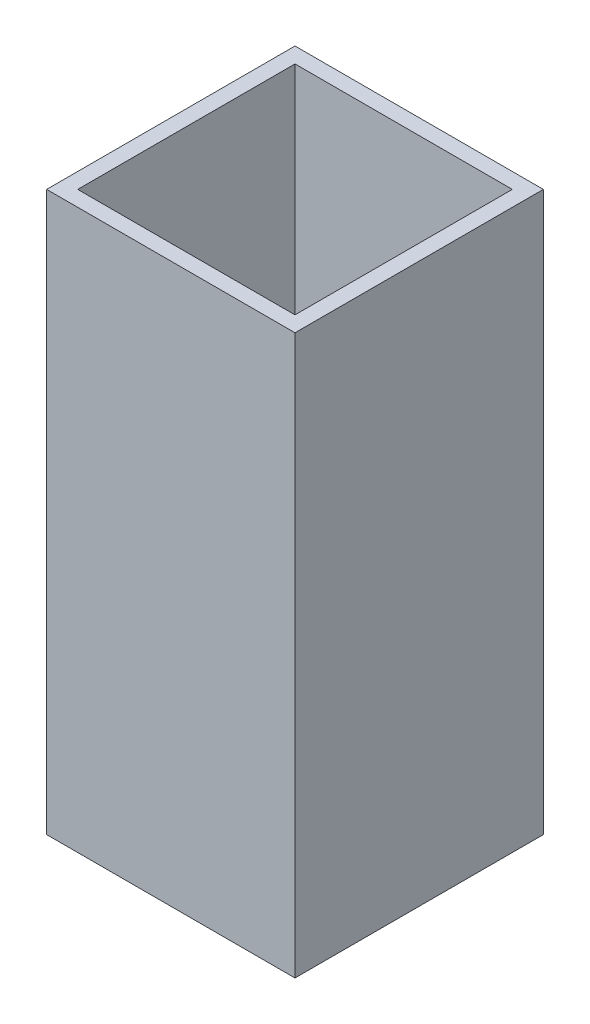
ISO-10303-21;
HEADER;
FILE_DESCRIPTION(('STEP AP214'),'2;1');
FILE_NAME('part.step','',(''),(''),'','','');
FILE_SCHEMA(('AUTOMOTIVE_DESIGN { 1 0 10303 214 1 1 1 1 }'));
ENDSEC;
DATA;
#1=APPLICATION_CONTEXT('core data for automotive mechanical design processes');
#2=APPLICATION_PROTOCOL_DEFINITION('international standard','automotive_design',2000,#1);
#3=PRODUCT_CONTEXT('',#1,'mechanical');
#4=PRODUCT('Part','Part','',(#3));
#5=PRODUCT_RELATED_PRODUCT_CATEGORY('part','',(#4));
#6=PRODUCT_DEFINITION_FORMATION('','',#4);
#7=PRODUCT_DEFINITION_CONTEXT('part definition',#1,'design');
#8=PRODUCT_DEFINITION('design','',#6,#7);
#9=PRODUCT_DEFINITION_SHAPE('','',#8);
#10=(LENGTH_UNIT() NAMED_UNIT(*) SI_UNIT(.MILLI.,.METRE.));
#11=(NAMED_UNIT(*) PLANE_ANGLE_UNIT() SI_UNIT($,.RADIAN.));
#12=(NAMED_UNIT(*) SI_UNIT($,.STERADIAN.) SOLID_ANGLE_UNIT());
#13=UNCERTAINTY_MEASURE_WITH_UNIT(LENGTH_MEASURE(1.E-05),#10,'distance_accuracy_value','');
#14=(GEOMETRIC_REPRESENTATION_CONTEXT(3) GLOBAL_UNCERTAINTY_ASSIGNED_CONTEXT((#13)) GLOBAL_UNIT_ASSIGNED_CONTEXT((#10,
#11,#12)) REPRESENTATION_CONTEXT('',''));
#15=CARTESIAN_POINT('',(0.,0.,0.));
#16=DIRECTION('',(0.,0.,1.));
#17=DIRECTION('',(1.,0.,0.));
#18=AXIS2_PLACEMENT_3D('',#15,#16,#17);
#19=CARTESIAN_POINT('',(0.,114.3,0.));
#20=DIRECTION('',(0.,1.,0.));
#21=DIRECTION('',(0.,0.,1.));
#22=AXIS2_PLACEMENT_3D('',#19,#20,#21);
#23=PLANE('',#22);
#24=DIRECTION('',(0.,0.,1.));
#25=VECTOR('',#24,1.);
#26=CARTESIAN_POINT('',(-25.4,114.3,25.4));
#27=LINE('',#26,#25);
#28=CARTESIAN_POINT('',(-25.4000000000001,114.3,-25.4));
#29=VERTEX_POINT('',#28);
#30=CARTESIAN_POINT('',(-25.4,114.3,25.4));
#31=VERTEX_POINT('',#30);
#32=EDGE_CURVE('E133',#29,#31,#27,.T.);
#33=ORIENTED_EDGE('',*,*,#32,.T.);
#34=DIRECTION('',(1.,0.,0.));
#35=VECTOR('',#34,1.);
#36=CARTESIAN_POINT('',(25.4000000000001,114.3,25.4));
#37=LINE('',#36,#35);
#38=CARTESIAN_POINT('',(25.4000000000001,114.3,25.4));
#39=VERTEX_POINT('',#38);
#40=EDGE_CURVE('E136',#31,#39,#37,.T.);
#41=ORIENTED_EDGE('',*,*,#40,.T.);
#42=DIRECTION('',(0.,0.,-1.));
#43=VECTOR('',#42,1.);
#44=CARTESIAN_POINT('',(25.4000000000001,114.3,25.4));
#45=LINE('',#44,#43);
#46=CARTESIAN_POINT('',(25.4000000000001,114.3,-25.4));
#47=VERTEX_POINT('',#46);
#48=EDGE_CURVE('E139',#39,#47,#45,.T.);
#49=ORIENTED_EDGE('',*,*,#48,.T.);
#50=DIRECTION('',(-1.,0.,0.));
#51=VECTOR('',#50,1.);
#52=CARTESIAN_POINT('',(25.4000000000001,114.3,-25.4));
#53=LINE('',#52,#51);
#54=EDGE_CURVE('E141',#47,#29,#53,.T.);
#55=ORIENTED_EDGE('',*,*,#54,.T.);
#56=EDGE_LOOP('',(#33,#41,#49,#55));
#57=FACE_BOUND('',#56,.T.);
#58=DIRECTION('',(0.,0.,-1.));
#59=VECTOR('',#58,1.);
#60=CARTESIAN_POINT('',(22.2249999999999,114.3,22.225));
#61=LINE('',#60,#59);
#62=CARTESIAN_POINT('',(22.2249999999999,114.3,22.225));
#63=VERTEX_POINT('',#62);
#64=CARTESIAN_POINT('',(22.2249999999999,114.3,-22.2250000000001));
#65=VERTEX_POINT('',#64);
#66=EDGE_CURVE('E105',#63,#65,#61,.T.);
#67=ORIENTED_EDGE('',*,*,#66,.F.);
#68=DIRECTION('',(1.,0.,0.));
#69=VECTOR('',#68,1.);
#70=CARTESIAN_POINT('',(22.2249999999999,114.3,22.225));
#71=LINE('',#70,#69);
#72=CARTESIAN_POINT('',(-22.2249999999999,114.3,22.225));
#73=VERTEX_POINT('',#72);
#74=EDGE_CURVE('E97',#73,#63,#71,.T.);
#75=ORIENTED_EDGE('',*,*,#74,.F.);
#76=DIRECTION('',(0.,0.,1.));
#77=VECTOR('',#76,1.);
#78=CARTESIAN_POINT('',(-22.2249999999999,114.3,22.225));
#79=LINE('',#78,#77);
#80=CARTESIAN_POINT('',(-22.2249999999999,114.3,-22.2249999999999));
#81=VERTEX_POINT('',#80);
#82=EDGE_CURVE('E119',#81,#73,#79,.T.);
#83=ORIENTED_EDGE('',*,*,#82,.F.);
#84=DIRECTION('',(-1.,0.,0.));
#85=VECTOR('',#84,1.);
#86=CARTESIAN_POINT('',(22.2249999999999,114.3,-22.2250000000001));
#87=LINE('',#86,#85);
#88=EDGE_CURVE('E117',#65,#81,#87,.T.);
#89=ORIENTED_EDGE('',*,*,#88,.F.);
#90=EDGE_LOOP('',(#67,#75,#83,#89));
#91=FACE_BOUND('',#90,.T.);
#92=ADVANCED_FACE('F32',(#57,#91),#23,.T.);
#93=CARTESIAN_POINT('',(0.,0.,0.));
#94=DIRECTION('',(0.,1.,0.));
#95=DIRECTION('',(0.,0.,1.));
#96=AXIS2_PLACEMENT_3D('',#93,#94,#95);
#97=PLANE('',#96);
#98=DIRECTION('',(0.,0.,1.));
#99=VECTOR('',#98,1.);
#100=CARTESIAN_POINT('',(-25.4,0.,25.4));
#101=LINE('',#100,#99);
#102=CARTESIAN_POINT('',(-25.4000000000001,0.,-25.4));
#103=VERTEX_POINT('',#102);
#104=CARTESIAN_POINT('',(-25.4,0.,25.4));
#105=VERTEX_POINT('',#104);
#106=EDGE_CURVE('E113',#103,#105,#101,.T.);
#107=ORIENTED_EDGE('',*,*,#106,.F.);
#108=DIRECTION('',(-1.,0.,0.));
#109=VECTOR('',#108,1.);
#110=CARTESIAN_POINT('',(25.4000000000001,0.,-25.4));
#111=LINE('',#110,#109);
#112=CARTESIAN_POINT('',(25.4000000000001,0.,-25.4));
#113=VERTEX_POINT('',#112);
#114=EDGE_CURVE('E137',#113,#103,#111,.T.);
#115=ORIENTED_EDGE('',*,*,#114,.F.);
#116=DIRECTION('',(0.,0.,-1.));
#117=VECTOR('',#116,1.);
#118=CARTESIAN_POINT('',(25.4000000000001,0.,25.4));
#119=LINE('',#118,#117);
#120=CARTESIAN_POINT('',(25.4000000000001,0.,25.4));
#121=VERTEX_POINT('',#120);
#122=EDGE_CURVE('E148',#121,#113,#119,.T.);
#123=ORIENTED_EDGE('',*,*,#122,.F.);
#124=DIRECTION('',(1.,0.,0.));
#125=VECTOR('',#124,1.);
#126=CARTESIAN_POINT('',(25.4000000000001,0.,25.4));
#127=LINE('',#126,#125);
#128=EDGE_CURVE('E146',#105,#121,#127,.T.);
#129=ORIENTED_EDGE('',*,*,#128,.F.);
#130=EDGE_LOOP('',(#107,#115,#123,#129));
#131=FACE_BOUND('',#130,.T.);
#132=DIRECTION('',(1.,0.,0.));
#133=VECTOR('',#132,1.);
#134=CARTESIAN_POINT('',(22.2249999999999,0.,22.225));
#135=LINE('',#134,#133);
#136=CARTESIAN_POINT('',(-22.2249999999999,0.,22.225));
#137=VERTEX_POINT('',#136);
#138=CARTESIAN_POINT('',(22.2249999999999,0.,22.225));
#139=VERTEX_POINT('',#138);
#140=EDGE_CURVE('E55',#137,#139,#135,.T.);
#141=ORIENTED_EDGE('',*,*,#140,.T.);
#142=DIRECTION('',(0.,0.,-1.));
#143=VECTOR('',#142,1.);
#144=CARTESIAN_POINT('',(22.2249999999999,0.,22.225));
#145=LINE('',#144,#143);
#146=CARTESIAN_POINT('',(22.2249999999999,0.,-22.2250000000001));
#147=VERTEX_POINT('',#146);
#148=EDGE_CURVE('E112',#139,#147,#145,.T.);
#149=ORIENTED_EDGE('',*,*,#148,.T.);
#150=DIRECTION('',(-1.,0.,0.));
#151=VECTOR('',#150,1.);
#152=CARTESIAN_POINT('',(22.2249999999999,0.,-22.2250000000001));
#153=LINE('',#152,#151);
#154=CARTESIAN_POINT('',(-22.2249999999999,0.,-22.2249999999999));
#155=VERTEX_POINT('',#154);
#156=EDGE_CURVE('E125',#147,#155,#153,.T.);
#157=ORIENTED_EDGE('',*,*,#156,.T.);
#158=DIRECTION('',(0.,0.,1.));
#159=VECTOR('',#158,1.);
#160=CARTESIAN_POINT('',(-22.2249999999999,0.,22.225));
#161=LINE('',#160,#159);
#162=EDGE_CURVE('E106',#155,#137,#161,.T.);
#163=ORIENTED_EDGE('',*,*,#162,.T.);
#164=EDGE_LOOP('',(#141,#149,#157,#163));
#165=FACE_BOUND('',#164,.T.);
#166=ADVANCED_FACE('F166',(#131,#165),#97,.F.);
#167=CARTESIAN_POINT('',(-25.4,114.3,25.4));
#168=DIRECTION('',(1.,0.,0.));
#169=DIRECTION('',(0.,0.,-1.));
#170=AXIS2_PLACEMENT_3D('',#167,#168,#169);
#171=PLANE('',#170);
#172=ORIENTED_EDGE('',*,*,#106,.T.);
#173=DIRECTION('',(0.,-1.,0.));
#174=VECTOR('',#173,1.);
#175=CARTESIAN_POINT('',(-25.4,114.3,25.4));
#176=LINE('',#175,#174);
#177=EDGE_CURVE('E11',#31,#105,#176,.T.);
#178=ORIENTED_EDGE('',*,*,#177,.F.);
#179=ORIENTED_EDGE('',*,*,#32,.F.);
#180=DIRECTION('',(0.,-1.,0.));
#181=VECTOR('',#180,1.);
#182=CARTESIAN_POINT('',(-25.4000000000001,114.3,-25.4));
#183=LINE('',#182,#181);
#184=EDGE_CURVE('E143',#29,#103,#183,.T.);
#185=ORIENTED_EDGE('',*,*,#184,.T.);
#186=EDGE_LOOP('',(#172,#178,#179,#185));
#187=FACE_BOUND('',#186,.T.);
#188=ADVANCED_FACE('F34',(#187),#171,.F.);
#189=CARTESIAN_POINT('',(25.4000000000001,114.3,25.4));
#190=DIRECTION('',(0.,0.,-1.));
#191=DIRECTION('',(-1.,0.,0.));
#192=AXIS2_PLACEMENT_3D('',#189,#190,#191);
#193=PLANE('',#192);
#194=ORIENTED_EDGE('',*,*,#128,.T.);
#195=DIRECTION('',(0.,-1.,0.));
#196=VECTOR('',#195,1.);
#197=CARTESIAN_POINT('',(25.4000000000001,114.3,25.4));
#198=LINE('',#197,#196);
#199=EDGE_CURVE('E40',#39,#121,#198,.T.);
#200=ORIENTED_EDGE('',*,*,#199,.F.);
#201=ORIENTED_EDGE('',*,*,#40,.F.);
#202=ORIENTED_EDGE('',*,*,#177,.T.);
#203=EDGE_LOOP('',(#194,#200,#201,#202));
#204=FACE_BOUND('',#203,.T.);
#205=ADVANCED_FACE('F176',(#204),#193,.F.);
#206=CARTESIAN_POINT('',(25.4000000000001,114.3,25.4));
#207=DIRECTION('',(-1.,0.,0.));
#208=DIRECTION('',(0.,0.,1.));
#209=AXIS2_PLACEMENT_3D('',#206,#207,#208);
#210=PLANE('',#209);
#211=ORIENTED_EDGE('',*,*,#122,.T.);
#212=DIRECTION('',(0.,-1.,0.));
#213=VECTOR('',#212,1.);
#214=CARTESIAN_POINT('',(25.4000000000001,114.3,-25.4));
#215=LINE('',#214,#213);
#216=EDGE_CURVE('E153',#47,#113,#215,.T.);
#217=ORIENTED_EDGE('',*,*,#216,.F.);
#218=ORIENTED_EDGE('',*,*,#48,.F.);
#219=ORIENTED_EDGE('',*,*,#199,.T.);
#220=EDGE_LOOP('',(#211,#217,#218,#219));
#221=FACE_BOUND('',#220,.T.);
#222=ADVANCED_FACE('F160',(#221),#210,.F.);
#223=CARTESIAN_POINT('',(25.4000000000001,114.3,-25.4));
#224=DIRECTION('',(0.,0.,1.));
#225=DIRECTION('',(1.,0.,0.));
#226=AXIS2_PLACEMENT_3D('',#223,#224,#225);
#227=PLANE('',#226);
#228=ORIENTED_EDGE('',*,*,#114,.T.);
#229=ORIENTED_EDGE('',*,*,#184,.F.);
#230=ORIENTED_EDGE('',*,*,#54,.F.);
#231=ORIENTED_EDGE('',*,*,#216,.T.);
#232=EDGE_LOOP('',(#228,#229,#230,#231));
#233=FACE_BOUND('',#232,.T.);
#234=ADVANCED_FACE('F170',(#233),#227,.F.);
#235=CARTESIAN_POINT('',(22.2249999999999,114.3,22.225));
#236=DIRECTION('',(0.,0.,-1.));
#237=DIRECTION('',(-1.,0.,0.));
#238=AXIS2_PLACEMENT_3D('',#235,#236,#237);
#239=PLANE('',#238);
#240=ORIENTED_EDGE('',*,*,#140,.F.);
#241=DIRECTION('',(0.,-1.,0.));
#242=VECTOR('',#241,1.);
#243=CARTESIAN_POINT('',(-22.2249999999999,114.3,22.225));
#244=LINE('',#243,#242);
#245=EDGE_CURVE('E101',#73,#137,#244,.T.);
#246=ORIENTED_EDGE('',*,*,#245,.F.);
#247=ORIENTED_EDGE('',*,*,#74,.T.);
#248=DIRECTION('',(0.,-1.,0.));
#249=VECTOR('',#248,1.);
#250=CARTESIAN_POINT('',(22.2249999999999,114.3,22.225));
#251=LINE('',#250,#249);
#252=EDGE_CURVE('E100',#63,#139,#251,.T.);
#253=ORIENTED_EDGE('',*,*,#252,.T.);
#254=EDGE_LOOP('',(#240,#246,#247,#253));
#255=FACE_BOUND('',#254,.T.);
#256=ADVANCED_FACE('F99',(#255),#239,.T.);
#257=CARTESIAN_POINT('',(22.2249999999999,114.3,22.225));
#258=DIRECTION('',(-1.,0.,0.));
#259=DIRECTION('',(0.,0.,1.));
#260=AXIS2_PLACEMENT_3D('',#257,#258,#259);
#261=PLANE('',#260);
#262=ORIENTED_EDGE('',*,*,#148,.F.);
#263=ORIENTED_EDGE('',*,*,#252,.F.);
#264=ORIENTED_EDGE('',*,*,#66,.T.);
#265=DIRECTION('',(0.,-1.,0.));
#266=VECTOR('',#265,1.);
#267=CARTESIAN_POINT('',(22.2249999999999,114.3,-22.2250000000001));
#268=LINE('',#267,#266);
#269=EDGE_CURVE('E114',#65,#147,#268,.T.);
#270=ORIENTED_EDGE('',*,*,#269,.T.);
#271=EDGE_LOOP('',(#262,#263,#264,#270));
#272=FACE_BOUND('',#271,.T.);
#273=ADVANCED_FACE('F109',(#272),#261,.T.);
#274=CARTESIAN_POINT('',(22.2249999999999,114.3,-22.2250000000001));
#275=DIRECTION('',(0.,0.,1.));
#276=DIRECTION('',(1.,0.,0.));
#277=AXIS2_PLACEMENT_3D('',#274,#275,#276);
#278=PLANE('',#277);
#279=ORIENTED_EDGE('',*,*,#156,.F.);
#280=ORIENTED_EDGE('',*,*,#269,.F.);
#281=ORIENTED_EDGE('',*,*,#88,.T.);
#282=DIRECTION('',(0.,-1.,0.));
#283=VECTOR('',#282,1.);
#284=CARTESIAN_POINT('',(-22.2249999999999,114.3,-22.2249999999999));
#285=LINE('',#284,#283);
#286=EDGE_CURVE('E47',#81,#155,#285,.T.);
#287=ORIENTED_EDGE('',*,*,#286,.T.);
#288=EDGE_LOOP('',(#279,#280,#281,#287));
#289=FACE_BOUND('',#288,.T.);
#290=ADVANCED_FACE('F199',(#289),#278,.T.);
#291=CARTESIAN_POINT('',(-22.2249999999999,114.3,22.225));
#292=DIRECTION('',(1.,0.,0.));
#293=DIRECTION('',(0.,0.,-1.));
#294=AXIS2_PLACEMENT_3D('',#291,#292,#293);
#295=PLANE('',#294);
#296=ORIENTED_EDGE('',*,*,#162,.F.);
#297=ORIENTED_EDGE('',*,*,#286,.F.);
#298=ORIENTED_EDGE('',*,*,#82,.T.);
#299=ORIENTED_EDGE('',*,*,#245,.T.);
#300=EDGE_LOOP('',(#296,#297,#298,#299));
#301=FACE_BOUND('',#300,.T.);
#302=ADVANCED_FACE('F203',(#301),#295,.T.);
#303=CLOSED_SHELL('',(#92,#166,#188,#205,#222,#234,#256,#273,#290,#302));
#304=MANIFOLD_SOLID_BREP('B2',#303);
#305=ADVANCED_BREP_SHAPE_REPRESENTATION('',(#18,#304),#14);
#306=SHAPE_DEFINITION_REPRESENTATION(#9,#305);
ENDSEC;
END-ISO-10303-21;
